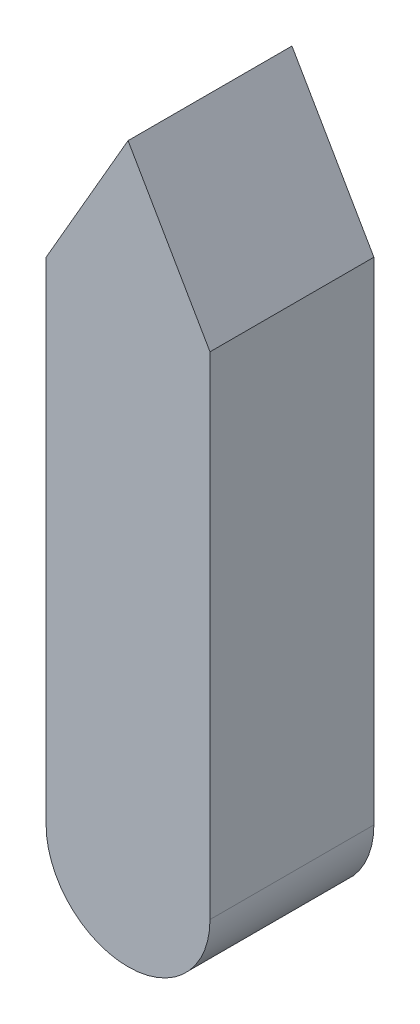
ISO-10303-21;
HEADER;
FILE_DESCRIPTION(('STEP AP214'),'2;1');
FILE_NAME('part.step','',(''),(''),'','','');
FILE_SCHEMA(('AUTOMOTIVE_DESIGN { 1 0 10303 214 1 1 1 1 }'));
ENDSEC;
DATA;
#1=APPLICATION_CONTEXT('core data for automotive mechanical design processes');
#2=APPLICATION_PROTOCOL_DEFINITION('international standard','automotive_design',2000,#1);
#3=PRODUCT_CONTEXT('',#1,'mechanical');
#4=PRODUCT('Part','Part','',(#3));
#5=PRODUCT_RELATED_PRODUCT_CATEGORY('part','',(#4));
#6=PRODUCT_DEFINITION_FORMATION('','',#4);
#7=PRODUCT_DEFINITION_CONTEXT('part definition',#1,'design');
#8=PRODUCT_DEFINITION('design','',#6,#7);
#9=PRODUCT_DEFINITION_SHAPE('','',#8);
#10=(LENGTH_UNIT() NAMED_UNIT(*) SI_UNIT(.MILLI.,.METRE.));
#11=(NAMED_UNIT(*) PLANE_ANGLE_UNIT() SI_UNIT($,.RADIAN.));
#12=(NAMED_UNIT(*) SI_UNIT($,.STERADIAN.) SOLID_ANGLE_UNIT());
#13=UNCERTAINTY_MEASURE_WITH_UNIT(LENGTH_MEASURE(1.E-05),#10,'distance_accuracy_value','');
#14=(GEOMETRIC_REPRESENTATION_CONTEXT(3) GLOBAL_UNCERTAINTY_ASSIGNED_CONTEXT((#13)) GLOBAL_UNIT_ASSIGNED_CONTEXT((#10,
#11,#12)) REPRESENTATION_CONTEXT('',''));
#15=CARTESIAN_POINT('',(0.,0.,0.));
#16=DIRECTION('',(0.,0.,1.));
#17=DIRECTION('',(1.,0.,0.));
#18=AXIS2_PLACEMENT_3D('',#15,#16,#17);
#19=CARTESIAN_POINT('',(102.451905283833,59.1506350946109,50.));
#20=DIRECTION('',(0.866025403784438,0.5,0.));
#21=DIRECTION('',(-0.5,0.866025403784439,0.));
#22=AXIS2_PLACEMENT_3D('',#19,#20,#21);
#23=PLANE('',#22);
#24=DIRECTION('',(0.5,-0.866025403784439,0.));
#25=VECTOR('',#24,1.);
#26=CARTESIAN_POINT('',(102.451905283833,59.1506350946109,-50.));
#27=LINE('',#26,#25);
#28=CARTESIAN_POINT('',(-1.2490009027033E-13,236.602540378444,-50.));
#29=VERTEX_POINT('',#28);
#30=CARTESIAN_POINT('',(49.9999999999998,150.,-50.));
#31=VERTEX_POINT('',#30);
#32=EDGE_CURVE('E108',#29,#31,#27,.T.);
#33=ORIENTED_EDGE('',*,*,#32,.F.);
#34=DIRECTION('',(0.,0.,-1.));
#35=VECTOR('',#34,1.);
#36=CARTESIAN_POINT('',(-1.2490009027033E-13,236.602540378444,50.));
#37=LINE('',#36,#35);
#38=CARTESIAN_POINT('',(-1.2490009027033E-13,236.602540378444,50.));
#39=VERTEX_POINT('',#38);
#40=EDGE_CURVE('E11',#39,#29,#37,.T.);
#41=ORIENTED_EDGE('',*,*,#40,.F.);
#42=DIRECTION('',(0.5,-0.866025403784439,0.));
#43=VECTOR('',#42,1.);
#44=CARTESIAN_POINT('',(102.451905283833,59.1506350946109,50.));
#45=LINE('',#44,#43);
#46=CARTESIAN_POINT('',(49.9999999999998,150.,50.));
#47=VERTEX_POINT('',#46);
#48=EDGE_CURVE('E103',#39,#47,#45,.T.);
#49=ORIENTED_EDGE('',*,*,#48,.T.);
#50=DIRECTION('',(0.,0.,-1.));
#51=VECTOR('',#50,1.);
#52=CARTESIAN_POINT('',(49.9999999999998,150.,50.));
#53=LINE('',#52,#51);
#54=EDGE_CURVE('E75',#47,#31,#53,.T.);
#55=ORIENTED_EDGE('',*,*,#54,.T.);
#56=EDGE_LOOP('',(#33,#41,#49,#55));
#57=FACE_BOUND('',#56,.T.);
#58=ADVANCED_FACE('F34',(#57),#23,.T.);
#59=CARTESIAN_POINT('',(-102.451905283833,59.1506350946109,50.));
#60=DIRECTION('',(-0.866025403784439,0.5,0.));
#61=DIRECTION('',(-0.5,-0.866025403784439,0.));
#62=AXIS2_PLACEMENT_3D('',#59,#60,#61);
#63=PLANE('',#62);
#64=DIRECTION('',(0.5,0.866025403784439,0.));
#65=VECTOR('',#64,1.);
#66=CARTESIAN_POINT('',(-102.451905283833,59.1506350946109,-50.));
#67=LINE('',#66,#65);
#68=CARTESIAN_POINT('',(-50.,150.,-50.));
#69=VERTEX_POINT('',#68);
#70=EDGE_CURVE('E111',#69,#29,#67,.T.);
#71=ORIENTED_EDGE('',*,*,#70,.F.);
#72=DIRECTION('',(0.,0.,-1.));
#73=VECTOR('',#72,1.);
#74=CARTESIAN_POINT('',(-50.,150.,50.));
#75=LINE('',#74,#73);
#76=CARTESIAN_POINT('',(-50.,150.,50.));
#77=VERTEX_POINT('',#76);
#78=EDGE_CURVE('E42',#77,#69,#75,.T.);
#79=ORIENTED_EDGE('',*,*,#78,.F.);
#80=DIRECTION('',(0.5,0.866025403784439,0.));
#81=VECTOR('',#80,1.);
#82=CARTESIAN_POINT('',(-102.451905283833,59.1506350946109,50.));
#83=LINE('',#82,#81);
#84=EDGE_CURVE('E101',#77,#39,#83,.T.);
#85=ORIENTED_EDGE('',*,*,#84,.T.);
#86=ORIENTED_EDGE('',*,*,#40,.T.);
#87=EDGE_LOOP('',(#71,#79,#85,#86));
#88=FACE_BOUND('',#87,.T.);
#89=ADVANCED_FACE('F121',(#88),#63,.T.);
#90=CARTESIAN_POINT('',(-50.,0.,50.));
#91=DIRECTION('',(-1.,0.,0.));
#92=DIRECTION('',(0.,0.,1.));
#93=AXIS2_PLACEMENT_3D('',#90,#91,#92);
#94=PLANE('',#93);
#95=DIRECTION('',(0.,1.,0.));
#96=VECTOR('',#95,1.);
#97=CARTESIAN_POINT('',(-50.,0.,-50.));
#98=LINE('',#97,#96);
#99=CARTESIAN_POINT('',(-50.,-150.,-50.));
#100=VERTEX_POINT('',#99);
#101=EDGE_CURVE('E92',#100,#69,#98,.T.);
#102=ORIENTED_EDGE('',*,*,#101,.F.);
#103=DIRECTION('',(0.,0.,-1.));
#104=VECTOR('',#103,1.);
#105=CARTESIAN_POINT('',(-50.,-150.,50.));
#106=LINE('',#105,#104);
#107=CARTESIAN_POINT('',(-50.,-150.,50.));
#108=VERTEX_POINT('',#107);
#109=EDGE_CURVE('E86',#108,#100,#106,.T.);
#110=ORIENTED_EDGE('',*,*,#109,.F.);
#111=DIRECTION('',(0.,1.,0.));
#112=VECTOR('',#111,1.);
#113=CARTESIAN_POINT('',(-50.,0.,50.));
#114=LINE('',#113,#112);
#115=EDGE_CURVE('E90',#108,#77,#114,.T.);
#116=ORIENTED_EDGE('',*,*,#115,.T.);
#117=ORIENTED_EDGE('',*,*,#78,.T.);
#118=EDGE_LOOP('',(#102,#110,#116,#117));
#119=FACE_BOUND('',#118,.T.);
#120=ADVANCED_FACE('F88',(#119),#94,.T.);
#121=CARTESIAN_POINT('',(0.,-150.,50.));
#122=DIRECTION('',(0.,0.,-1.));
#123=DIRECTION('',(-1.,0.,0.));
#124=AXIS2_PLACEMENT_3D('',#121,#122,#123);
#125=CYLINDRICAL_SURFACE('',#124,50.);
#126=CARTESIAN_POINT('',(0.,-150.,-50.));
#127=DIRECTION('',(0.,0.,1.));
#128=DIRECTION('',(1.,0.,0.));
#129=AXIS2_PLACEMENT_3D('',#126,#127,#128);
#130=CIRCLE('',#129,50.);
#131=CARTESIAN_POINT('',(50.,-150.,-50.));
#132=VERTEX_POINT('',#131);
#133=EDGE_CURVE('E68',#100,#132,#130,.T.);
#134=ORIENTED_EDGE('',*,*,#133,.T.);
#135=DIRECTION('',(0.,0.,-1.));
#136=VECTOR('',#135,1.);
#137=CARTESIAN_POINT('',(50.,-150.,50.));
#138=LINE('',#137,#136);
#139=CARTESIAN_POINT('',(50.,-150.,50.));
#140=VERTEX_POINT('',#139);
#141=EDGE_CURVE('E93',#140,#132,#138,.T.);
#142=ORIENTED_EDGE('',*,*,#141,.F.);
#143=CARTESIAN_POINT('',(0.,-150.,50.));
#144=DIRECTION('',(0.,0.,1.));
#145=DIRECTION('',(1.,0.,0.));
#146=AXIS2_PLACEMENT_3D('',#143,#144,#145);
#147=CIRCLE('',#146,50.);
#148=EDGE_CURVE('E95',#108,#140,#147,.T.);
#149=ORIENTED_EDGE('',*,*,#148,.F.);
#150=ORIENTED_EDGE('',*,*,#109,.T.);
#151=EDGE_LOOP('',(#134,#142,#149,#150));
#152=FACE_BOUND('',#151,.T.);
#153=ADVANCED_FACE('F96',(#152),#125,.T.);
#154=CARTESIAN_POINT('',(49.9999999999999,0.,50.));
#155=DIRECTION('',(-1.,0.,0.));
#156=DIRECTION('',(0.,-1.,0.));
#157=AXIS2_PLACEMENT_3D('',#154,#155,#156);
#158=PLANE('',#157);
#159=DIRECTION('',(0.,1.,0.));
#160=VECTOR('',#159,1.);
#161=CARTESIAN_POINT('',(49.9999999999999,0.,-50.));
#162=LINE('',#161,#160);
#163=EDGE_CURVE('E116',#132,#31,#162,.T.);
#164=ORIENTED_EDGE('',*,*,#163,.T.);
#165=ORIENTED_EDGE('',*,*,#54,.F.);
#166=DIRECTION('',(0.,1.,0.));
#167=VECTOR('',#166,1.);
#168=CARTESIAN_POINT('',(49.9999999999999,0.,50.));
#169=LINE('',#168,#167);
#170=EDGE_CURVE('E50',#140,#47,#169,.T.);
#171=ORIENTED_EDGE('',*,*,#170,.F.);
#172=ORIENTED_EDGE('',*,*,#141,.T.);
#173=EDGE_LOOP('',(#164,#165,#171,#172));
#174=FACE_BOUND('',#173,.T.);
#175=ADVANCED_FACE('F126',(#174),#158,.F.);
#176=CARTESIAN_POINT('',(0.,0.,50.));
#177=DIRECTION('',(0.,0.,1.));
#178=DIRECTION('',(1.,0.,0.));
#179=AXIS2_PLACEMENT_3D('',#176,#177,#178);
#180=PLANE('',#179);
#181=ORIENTED_EDGE('',*,*,#48,.F.);
#182=ORIENTED_EDGE('',*,*,#84,.F.);
#183=ORIENTED_EDGE('',*,*,#115,.F.);
#184=ORIENTED_EDGE('',*,*,#148,.T.);
#185=ORIENTED_EDGE('',*,*,#170,.T.);
#186=EDGE_LOOP('',(#181,#182,#183,#184,#185));
#187=FACE_BOUND('',#186,.T.);
#188=ADVANCED_FACE('F99',(#187),#180,.T.);
#189=CARTESIAN_POINT('',(0.,0.,-50.));
#190=DIRECTION('',(0.,0.,1.));
#191=DIRECTION('',(1.,0.,0.));
#192=AXIS2_PLACEMENT_3D('',#189,#190,#191);
#193=PLANE('',#192);
#194=ORIENTED_EDGE('',*,*,#32,.T.);
#195=ORIENTED_EDGE('',*,*,#163,.F.);
#196=ORIENTED_EDGE('',*,*,#133,.F.);
#197=ORIENTED_EDGE('',*,*,#101,.T.);
#198=ORIENTED_EDGE('',*,*,#70,.T.);
#199=EDGE_LOOP('',(#194,#195,#196,#197,#198));
#200=FACE_BOUND('',#199,.T.);
#201=ADVANCED_FACE('F123',(#200),#193,.F.);
#202=CLOSED_SHELL('',(#58,#89,#120,#153,#175,#188,#201));
#203=MANIFOLD_SOLID_BREP('B2',#202);
#204=ADVANCED_BREP_SHAPE_REPRESENTATION('',(#18,#203),#14);
#205=SHAPE_DEFINITION_REPRESENTATION(#9,#204);
ENDSEC;
END-ISO-10303-21;
